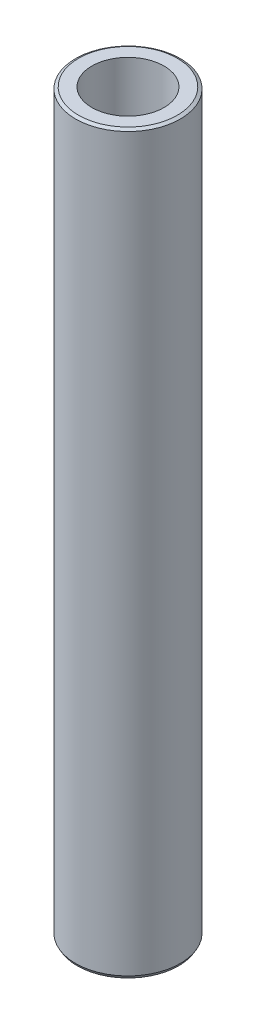
ISO-10303-21;
HEADER;
FILE_DESCRIPTION(('STEP AP214'),'2;1');
FILE_NAME('part.step','',(''),(''),'','','');
FILE_SCHEMA(('AUTOMOTIVE_DESIGN { 1 0 10303 214 1 1 1 1 }'));
ENDSEC;
DATA;
#1=APPLICATION_CONTEXT('core data for automotive mechanical design processes');
#2=APPLICATION_PROTOCOL_DEFINITION('international standard','automotive_design',2000,#1);
#3=PRODUCT_CONTEXT('',#1,'mechanical');
#4=PRODUCT('Part','Part','',(#3));
#5=PRODUCT_RELATED_PRODUCT_CATEGORY('part','',(#4));
#6=PRODUCT_DEFINITION_FORMATION('','',#4);
#7=PRODUCT_DEFINITION_CONTEXT('part definition',#1,'design');
#8=PRODUCT_DEFINITION('design','',#6,#7);
#9=PRODUCT_DEFINITION_SHAPE('','',#8);
#10=(LENGTH_UNIT() NAMED_UNIT(*) SI_UNIT(.MILLI.,.METRE.));
#11=(NAMED_UNIT(*) PLANE_ANGLE_UNIT() SI_UNIT($,.RADIAN.));
#12=(NAMED_UNIT(*) SI_UNIT($,.STERADIAN.) SOLID_ANGLE_UNIT());
#13=UNCERTAINTY_MEASURE_WITH_UNIT(LENGTH_MEASURE(1.E-05),#10,'distance_accuracy_value','');
#14=(GEOMETRIC_REPRESENTATION_CONTEXT(3) GLOBAL_UNCERTAINTY_ASSIGNED_CONTEXT((#13)) GLOBAL_UNIT_ASSIGNED_CONTEXT((#10,
#11,#12)) REPRESENTATION_CONTEXT('',''));
#15=CARTESIAN_POINT('',(0.,0.,0.));
#16=DIRECTION('',(0.,0.,1.));
#17=DIRECTION('',(1.,0.,0.));
#18=AXIS2_PLACEMENT_3D('',#15,#16,#17);
#19=CARTESIAN_POINT('',(0.,456.601619937269,0.));
#20=DIRECTION('',(0.,-1.,0.));
#21=DIRECTION('',(0.,0.,-1.));
#22=AXIS2_PLACEMENT_3D('',#19,#20,#21);
#23=CYLINDRICAL_SURFACE('',#22,32.5);
#24=CARTESIAN_POINT('',(0.,455.523649978372,0.));
#25=DIRECTION('',(0.,1.,0.));
#26=DIRECTION('',(0.,0.,1.));
#27=AXIS2_PLACEMENT_3D('',#24,#25,#26);
#28=CIRCLE('',#27,32.5);
#29=CARTESIAN_POINT('',(0.,455.523649978372,32.5));
#30=VERTEX_POINT('',#29);
#31=EDGE_CURVE('E50',#30,#30,#28,.F.);
#32=ORIENTED_EDGE('',*,*,#31,.T.);
#33=EDGE_LOOP('',(#32));
#34=FACE_BOUND('',#33,.T.);
#35=CARTESIAN_POINT('',(0.,1.86709873784247,0.));
#36=DIRECTION('',(0.,1.,0.));
#37=DIRECTION('',(0.,0.,1.));
#38=AXIS2_PLACEMENT_3D('',#35,#36,#37);
#39=CIRCLE('',#38,32.5);
#40=CARTESIAN_POINT('',(0.,1.86709873784247,32.5));
#41=VERTEX_POINT('',#40);
#42=EDGE_CURVE('E51',#41,#41,#39,.T.);
#43=ORIENTED_EDGE('',*,*,#42,.T.);
#44=EDGE_LOOP('',(#43));
#45=FACE_BOUND('',#44,.T.);
#46=ADVANCED_FACE('F39',(#34,#45),#23,.T.);
#47=CARTESIAN_POINT('',(0.,456.601619937269,0.));
#48=DIRECTION('',(0.,1.,0.));
#49=DIRECTION('',(0.,0.,1.));
#50=AXIS2_PLACEMENT_3D('',#47,#48,#49);
#51=PLANE('',#50);
#52=CARTESIAN_POINT('',(0.,456.601619937269,0.));
#53=DIRECTION('',(0.,1.,0.));
#54=DIRECTION('',(0.,0.,1.));
#55=AXIS2_PLACEMENT_3D('',#52,#53,#54);
#56=CIRCLE('',#55,30.6329012621577);
#57=CARTESIAN_POINT('',(0.,456.601619937269,30.6329012621577));
#58=VERTEX_POINT('',#57);
#59=EDGE_CURVE('E54',#58,#58,#56,.T.);
#60=ORIENTED_EDGE('',*,*,#59,.T.);
#61=EDGE_LOOP('',(#60));
#62=FACE_BOUND('',#61,.T.);
#63=CARTESIAN_POINT('',(0.,456.601619937269,0.));
#64=DIRECTION('',(0.,1.,0.));
#65=DIRECTION('',(0.,0.,1.));
#66=AXIS2_PLACEMENT_3D('',#63,#64,#65);
#67=CIRCLE('',#66,22.3705060824671);
#68=CARTESIAN_POINT('',(0.,456.601619937269,22.3705060824671));
#69=VERTEX_POINT('',#68);
#70=EDGE_CURVE('E58',#69,#69,#67,.T.);
#71=ORIENTED_EDGE('',*,*,#70,.F.);
#72=EDGE_LOOP('',(#71));
#73=FACE_BOUND('',#72,.T.);
#74=ADVANCED_FACE('F69',(#62,#73),#51,.T.);
#75=CARTESIAN_POINT('',(0.,0.,0.));
#76=DIRECTION('',(0.,1.,0.));
#77=DIRECTION('',(0.,0.,1.));
#78=AXIS2_PLACEMENT_3D('',#75,#76,#77);
#79=PLANE('',#78);
#80=CARTESIAN_POINT('',(0.,0.,0.));
#81=DIRECTION('',(0.,1.,0.));
#82=DIRECTION('',(0.,0.,1.));
#83=AXIS2_PLACEMENT_3D('',#80,#81,#82);
#84=CIRCLE('',#83,31.4220300411031);
#85=CARTESIAN_POINT('',(0.,0.,31.4220300411031));
#86=VERTEX_POINT('',#85);
#87=EDGE_CURVE('E10',#86,#86,#84,.F.);
#88=ORIENTED_EDGE('',*,*,#87,.T.);
#89=EDGE_LOOP('',(#88));
#90=FACE_BOUND('',#89,.T.);
#91=CARTESIAN_POINT('',(0.,0.,0.));
#92=DIRECTION('',(0.,1.,0.));
#93=DIRECTION('',(0.,0.,1.));
#94=AXIS2_PLACEMENT_3D('',#91,#92,#93);
#95=CIRCLE('',#94,22.3705060824671);
#96=CARTESIAN_POINT('',(0.,0.,22.3705060824671));
#97=VERTEX_POINT('',#96);
#98=EDGE_CURVE('E63',#97,#97,#95,.T.);
#99=ORIENTED_EDGE('',*,*,#98,.T.);
#100=EDGE_LOOP('',(#99));
#101=FACE_BOUND('',#100,.T.);
#102=ADVANCED_FACE('F75',(#90,#101),#79,.F.);
#103=CARTESIAN_POINT('',(0.,456.601619937269,0.));
#104=DIRECTION('',(0.,-1.,0.));
#105=DIRECTION('',(0.,0.,-1.));
#106=AXIS2_PLACEMENT_3D('',#103,#104,#105);
#107=CYLINDRICAL_SURFACE('',#106,22.3705060824671);
#108=ORIENTED_EDGE('',*,*,#70,.T.);
#109=EDGE_LOOP('',(#108));
#110=FACE_BOUND('',#109,.T.);
#111=ORIENTED_EDGE('',*,*,#98,.F.);
#112=EDGE_LOOP('',(#111));
#113=FACE_BOUND('',#112,.T.);
#114=ADVANCED_FACE('F70',(#110,#113),#107,.F.);
#115=CARTESIAN_POINT('',(0.,456.601619937269,0.));
#116=DIRECTION('',(0.,-1.,0.));
#117=DIRECTION('',(0.,0.,-1.));
#118=AXIS2_PLACEMENT_3D('',#115,#116,#117);
#119=CONICAL_SURFACE('',#118,30.6329012621577,1.04719755119659);
#120=ORIENTED_EDGE('',*,*,#31,.F.);
#121=EDGE_LOOP('',(#120));
#122=FACE_BOUND('',#121,.T.);
#123=ORIENTED_EDGE('',*,*,#59,.F.);
#124=EDGE_LOOP('',(#123));
#125=FACE_BOUND('',#124,.T.);
#126=ADVANCED_FACE('F81',(#122,#125),#119,.T.);
#127=CARTESIAN_POINT('',(0.,1.86709873784247,0.));
#128=DIRECTION('',(0.,1.,0.));
#129=DIRECTION('',(0.,0.,1.));
#130=AXIS2_PLACEMENT_3D('',#127,#128,#129);
#131=CONICAL_SURFACE('',#130,32.5,0.523598775598294);
#132=CARTESIAN_POINT('',(0.,0.,31.4220300411031));
#133=CARTESIAN_POINT('',(0.,0.0194489451858586,31.4332588948416));
#134=CARTESIAN_POINT('',(0.,0.0388978903717177,31.4444877485801));
#135=CARTESIAN_POINT('',(0.,0.0777957807434359,31.4669454560571));
#136=CARTESIAN_POINT('',(0.,0.097244725929295,31.4781743097956));
#137=CARTESIAN_POINT('',(0.,0.136142616301013,31.5006320172726));
#138=CARTESIAN_POINT('',(0.,0.155591561486871,31.5118608710111));
#139=CARTESIAN_POINT('',(0.,0.19448945185859,31.5343185784882));
#140=CARTESIAN_POINT('',(0.,0.213938397044449,31.5455474322267));
#141=CARTESIAN_POINT('',(0.,0.252836287416168,31.5680051397037));
#142=CARTESIAN_POINT('',(0.,0.272285232602026,31.5792339934422));
#143=CARTESIAN_POINT('',(0.,0.311183122973744,31.6016917009192));
#144=CARTESIAN_POINT('',(0.,0.330632068159603,31.6129205546577));
#145=CARTESIAN_POINT('',(0.,0.369529958531321,31.6353782621347));
#146=CARTESIAN_POINT('',(0.,0.38897890371718,31.6466071158732));
#147=CARTESIAN_POINT('',(0.,0.427876794088898,31.6690648233503));
#148=CARTESIAN_POINT('',(0.,0.447325739274757,31.6802936770888));
#149=CARTESIAN_POINT('',(0.,0.486223629646475,31.7027513845658));
#150=CARTESIAN_POINT('',(0.,0.505672574832334,31.7139802383043));
#151=CARTESIAN_POINT('',(0.,0.544570465204052,31.7364379457813));
#152=CARTESIAN_POINT('',(0.,0.564019410389911,31.7476667995198));
#153=CARTESIAN_POINT('',(0.,0.602917300761629,31.7701245069969));
#154=CARTESIAN_POINT('',(0.,0.622366245947488,31.7813533607354));
#155=CARTESIAN_POINT('',(0.,0.661264136319206,31.8038110682124));
#156=CARTESIAN_POINT('',(0.,0.680713081505066,31.8150399219509));
#157=CARTESIAN_POINT('',(0.,0.719610971876784,31.8374976294279));
#158=CARTESIAN_POINT('',(0.,0.739059917062643,31.8487264831664));
#159=CARTESIAN_POINT('',(0.,0.77795780743436,31.8711841906435));
#160=CARTESIAN_POINT('',(0.,0.797406752620219,31.882413044382));
#161=CARTESIAN_POINT('',(0.,0.836304642991938,31.904870751859));
#162=CARTESIAN_POINT('',(0.,0.855753588177797,31.9160996055975));
#163=CARTESIAN_POINT('',(0.,0.894651478549515,31.9385573130745));
#164=CARTESIAN_POINT('',(0.,0.914100423735374,31.949786166813));
#165=CARTESIAN_POINT('',(0.,0.952998314107092,31.97224387429));
#166=CARTESIAN_POINT('',(0.,0.972447259292951,31.9834727280285));
#167=CARTESIAN_POINT('',(0.,1.01134514966467,32.0059304355056));
#168=CARTESIAN_POINT('',(0.,1.03079409485053,32.0171592892441));
#169=CARTESIAN_POINT('',(0.,1.06969198522225,32.0396169967211));
#170=CARTESIAN_POINT('',(0.,1.0891409304081,32.0508458504596));
#171=CARTESIAN_POINT('',(0.,1.12803882077982,32.0733035579366));
#172=CARTESIAN_POINT('',(0.,1.14748776596568,32.0845324116751));
#173=CARTESIAN_POINT('',(0.,1.1863856563374,32.1069901191522));
#174=CARTESIAN_POINT('',(0.,1.20583460152326,32.1182189728907));
#175=CARTESIAN_POINT('',(0.,1.24473249189498,32.1406766803677));
#176=CARTESIAN_POINT('',(0.,1.26418143708084,32.1519055341062));
#177=CARTESIAN_POINT('',(0.,1.30307932745255,32.1743632415832));
#178=CARTESIAN_POINT('',(0.,1.32252827263841,32.1855920953217));
#179=CARTESIAN_POINT('',(0.,1.36142616301013,32.2080498027987));
#180=CARTESIAN_POINT('',(0.,1.38087510819599,32.2192786565372));
#181=CARTESIAN_POINT('',(0.,1.41977299856771,32.2417363640143));
#182=CARTESIAN_POINT('',(0.,1.43922194375357,32.2529652177528));
#183=CARTESIAN_POINT('',(0.,1.47811983412529,32.2754229252298));
#184=CARTESIAN_POINT('',(0.,1.49756877931114,32.2866517789683));
#185=CARTESIAN_POINT('',(0.,1.53646666968286,32.3091094864453));
#186=CARTESIAN_POINT('',(0.,1.55591561486872,32.3203383401838));
#187=CARTESIAN_POINT('',(0.,1.59481350524044,32.3427960476609));
#188=CARTESIAN_POINT('',(0.,1.6142624504263,32.3540249013994));
#189=CARTESIAN_POINT('',(0.,1.65316034079802,32.3764826088764));
#190=CARTESIAN_POINT('',(0.,1.67260928598388,32.3877114626149));
#191=CARTESIAN_POINT('',(0.,1.71150717635559,32.4101691700919));
#192=CARTESIAN_POINT('',(0.,1.73095612154145,32.4213980238304));
#193=CARTESIAN_POINT('',(0.,1.76985401191317,32.4438557313075));
#194=CARTESIAN_POINT('',(0.,1.78930295709903,32.455084585046));
#195=CARTESIAN_POINT('',(0.,1.82820084747075,32.477542292523));
#196=CARTESIAN_POINT('',(0.,1.84764979265661,32.4887711462615));
#197=CARTESIAN_POINT('',(0.,1.86709873784247,32.5));
#198=B_SPLINE_CURVE_WITH_KNOTS('',3,(#132,#133,#134,#135,#136,#137,#138,#139,#140,#141,#142,
#143,#144,#145,#146,#147,#148,#149,#150,#151,#152,#153,#154,#155,#156,#157,#158,#159,#160,#161,
#162,#163,#164,#165,#166,#167,#168,#169,#170,#171,#172,#173,#174,#175,#176,#177,#178,#179,#180,
#181,#182,#183,#184,#185,#186,#187,#188,#189,#190,#191,#192,#193,#194,#195,#196,#197),
.UNSPECIFIED.,.F.,.F.,(4,2,2,2,2,2,2,2,2,2,2,2,2,2,2,2,2,2,2,2,2,2,2,2,2,2,2,2,2,2,2,2,4),(0.,
0.0673731224310601,0.13474624486212,0.20211936729318,0.269492489724237,0.336865612155297,
0.404238734586357,0.471611857017417,0.538984979448477,0.606358101879538,0.673731224310598,
0.741104346741658,0.808477469172715,0.875850591603775,0.943223714034835,1.01059683646589,
1.07796995889695,1.14534308132802,1.21271620375908,1.28008932619014,1.34746244862119,
1.41483557105225,1.48220869348331,1.54958181591437,1.61695493834543,1.68432806077649,
1.75170118320755,1.81907430563861,1.88644742806967,1.95382055050073,2.02119367293179,
2.08856679536285,2.15593991779391),.UNSPECIFIED.);
#199=EDGE_CURVE('BSEAM45',#86,#41,#198,.T.);
#200=ORIENTED_EDGE('',*,*,#87,.F.);
#201=ORIENTED_EDGE('',*,*,#42,.F.);
#202=ORIENTED_EDGE('',*,*,#199,.T.);
#203=ORIENTED_EDGE('',*,*,#199,.F.);
#204=EDGE_LOOP('',(#200,#202,#201,#203));
#205=FACE_BOUND('',#204,.T.);
#206=ADVANCED_FACE('F45',(#205),#131,.T.);
#207=CLOSED_SHELL('',(#46,#74,#102,#114,#126,#206));
#208=MANIFOLD_SOLID_BREP('B2',#207);
#209=ADVANCED_BREP_SHAPE_REPRESENTATION('',(#18,#208),#14);
#210=SHAPE_DEFINITION_REPRESENTATION(#9,#209);
ENDSEC;
END-ISO-10303-21;
